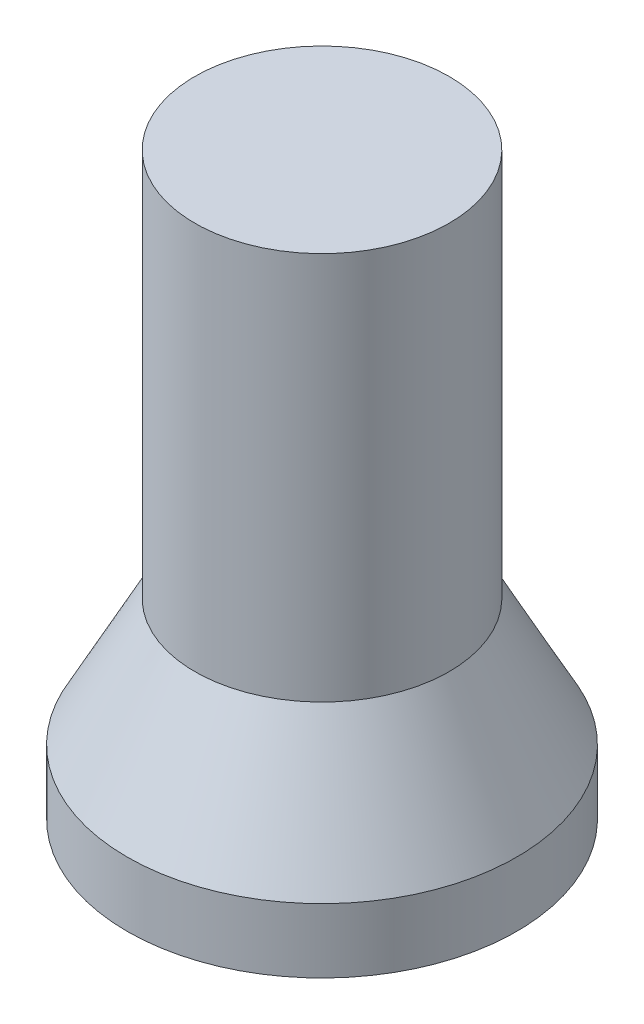
ISO-10303-21;
HEADER;
FILE_DESCRIPTION(('STEP AP214'),'2;1');
FILE_NAME('part.step','',(''),(''),'','','');
FILE_SCHEMA(('AUTOMOTIVE_DESIGN { 1 0 10303 214 1 1 1 1 }'));
ENDSEC;
DATA;
#1=APPLICATION_CONTEXT('core data for automotive mechanical design processes');
#2=APPLICATION_PROTOCOL_DEFINITION('international standard','automotive_design',2000,#1);
#3=PRODUCT_CONTEXT('',#1,'mechanical');
#4=PRODUCT('Part','Part','',(#3));
#5=PRODUCT_RELATED_PRODUCT_CATEGORY('part','',(#4));
#6=PRODUCT_DEFINITION_FORMATION('','',#4);
#7=PRODUCT_DEFINITION_CONTEXT('part definition',#1,'design');
#8=PRODUCT_DEFINITION('design','',#6,#7);
#9=PRODUCT_DEFINITION_SHAPE('','',#8);
#10=(LENGTH_UNIT() NAMED_UNIT(*) SI_UNIT(.MILLI.,.METRE.));
#11=(NAMED_UNIT(*) PLANE_ANGLE_UNIT() SI_UNIT($,.RADIAN.));
#12=(NAMED_UNIT(*) SI_UNIT($,.STERADIAN.) SOLID_ANGLE_UNIT());
#13=UNCERTAINTY_MEASURE_WITH_UNIT(LENGTH_MEASURE(1.E-05),#10,'distance_accuracy_value','');
#14=(GEOMETRIC_REPRESENTATION_CONTEXT(3) GLOBAL_UNCERTAINTY_ASSIGNED_CONTEXT((#13)) GLOBAL_UNIT_ASSIGNED_CONTEXT((#10,
#11,#12)) REPRESENTATION_CONTEXT('',''));
#15=CARTESIAN_POINT('',(0.,0.,0.));
#16=DIRECTION('',(0.,0.,1.));
#17=DIRECTION('',(1.,0.,0.));
#18=AXIS2_PLACEMENT_3D('',#15,#16,#17);
#19=CARTESIAN_POINT('',(0.,3.,-4.51666666666667));
#20=DIRECTION('',(0.,-1.,0.));
#21=DIRECTION('',(0.,0.,-1.));
#22=AXIS2_PLACEMENT_3D('',#19,#20,#21);
#23=PLANE('',#22);
#24=CARTESIAN_POINT('',(0.,3.,0.));
#25=DIRECTION('',(0.,-1.,0.));
#26=DIRECTION('',(0.,0.,-1.));
#27=AXIS2_PLACEMENT_3D('',#24,#25,#26);
#28=CIRCLE('',#27,4.51666666666667);
#29=CARTESIAN_POINT('',(0.,3.,-4.51666666666667));
#30=VERTEX_POINT('',#29);
#31=EDGE_CURVE('E58',#30,#30,#28,.T.);
#32=ORIENTED_EDGE('',*,*,#31,.T.);
#33=EDGE_LOOP('',(#32));
#34=FACE_BOUND('',#33,.T.);
#35=ADVANCED_FACE('F33',(#34),#23,.T.);
#36=CARTESIAN_POINT('',(0.,18.,0.));
#37=DIRECTION('',(0.,1.,0.));
#38=DIRECTION('',(0.,0.,1.));
#39=AXIS2_PLACEMENT_3D('',#36,#37,#38);
#40=PLANE('',#39);
#41=CARTESIAN_POINT('',(0.,18.,0.));
#42=DIRECTION('',(0.,-1.,0.));
#43=DIRECTION('',(0.,0.,-1.));
#44=AXIS2_PLACEMENT_3D('',#41,#42,#43);
#45=CIRCLE('',#44,3.95);
#46=CARTESIAN_POINT('',(0.,18.,-3.95));
#47=VERTEX_POINT('',#46);
#48=EDGE_CURVE('E10',#47,#47,#45,.T.);
#49=ORIENTED_EDGE('',*,*,#48,.F.);
#50=EDGE_LOOP('',(#49));
#51=FACE_BOUND('',#50,.T.);
#52=ADVANCED_FACE('F75',(#51),#40,.T.);
#53=CARTESIAN_POINT('',(0.,-43.5149122258906,0.));
#54=DIRECTION('',(0.,-1.,0.));
#55=DIRECTION('',(0.,0.,-1.));
#56=AXIS2_PLACEMENT_3D('',#53,#54,#55);
#57=CYLINDRICAL_SURFACE('',#56,3.95);
#58=ORIENTED_EDGE('',*,*,#48,.T.);
#59=EDGE_LOOP('',(#58));
#60=FACE_BOUND('',#59,.T.);
#61=CARTESIAN_POINT('',(0.,5.9375,0.));
#62=DIRECTION('',(0.,-1.,0.));
#63=DIRECTION('',(0.,0.,-1.));
#64=AXIS2_PLACEMENT_3D('',#61,#62,#63);
#65=CIRCLE('',#64,3.95);
#66=CARTESIAN_POINT('',(0.,5.9375,-3.95));
#67=VERTEX_POINT('',#66);
#68=EDGE_CURVE('E39',#67,#67,#65,.T.);
#69=ORIENTED_EDGE('',*,*,#68,.F.);
#70=EDGE_LOOP('',(#69));
#71=FACE_BOUND('',#70,.T.);
#72=ADVANCED_FACE('F79',(#60,#71),#57,.T.);
#73=CARTESIAN_POINT('',(0.,2.,0.));
#74=DIRECTION('',(0.,-1.,0.));
#75=DIRECTION('',(0.,0.,-1.));
#76=AXIS2_PLACEMENT_3D('',#73,#74,#75);
#77=CONICAL_SURFACE('',#76,6.05,0.489957326253728);
#78=ORIENTED_EDGE('',*,*,#68,.T.);
#79=EDGE_LOOP('',(#78));
#80=FACE_BOUND('',#79,.T.);
#81=CARTESIAN_POINT('',(0.,2.,0.));
#82=DIRECTION('',(0.,-1.,0.));
#83=DIRECTION('',(0.,0.,-1.));
#84=AXIS2_PLACEMENT_3D('',#81,#82,#83);
#85=CIRCLE('',#84,6.05);
#86=CARTESIAN_POINT('',(0.,2.,-6.05));
#87=VERTEX_POINT('',#86);
#88=EDGE_CURVE('E43',#87,#87,#85,.T.);
#89=ORIENTED_EDGE('',*,*,#88,.F.);
#90=EDGE_LOOP('',(#89));
#91=FACE_BOUND('',#90,.T.);
#92=ADVANCED_FACE('F84',(#80,#91),#77,.T.);
#93=CARTESIAN_POINT('',(0.,-43.5149122258906,0.));
#94=DIRECTION('',(0.,-1.,0.));
#95=DIRECTION('',(0.,0.,-1.));
#96=AXIS2_PLACEMENT_3D('',#93,#94,#95);
#97=CYLINDRICAL_SURFACE('',#96,6.05);
#98=ORIENTED_EDGE('',*,*,#88,.T.);
#99=EDGE_LOOP('',(#98));
#100=FACE_BOUND('',#99,.T.);
#101=CARTESIAN_POINT('',(0.,0.,0.));
#102=DIRECTION('',(0.,-1.,0.));
#103=DIRECTION('',(0.,0.,-1.));
#104=AXIS2_PLACEMENT_3D('',#101,#102,#103);
#105=CIRCLE('',#104,6.05);
#106=CARTESIAN_POINT('',(0.,0.,-6.05));
#107=VERTEX_POINT('',#106);
#108=EDGE_CURVE('E47',#107,#107,#105,.T.);
#109=ORIENTED_EDGE('',*,*,#108,.F.);
#110=EDGE_LOOP('',(#109));
#111=FACE_BOUND('',#110,.T.);
#112=ADVANCED_FACE('F89',(#100,#111),#97,.T.);
#113=CARTESIAN_POINT('',(0.,0.,-5.05));
#114=DIRECTION('',(0.,-1.,0.));
#115=DIRECTION('',(0.,0.,-1.));
#116=AXIS2_PLACEMENT_3D('',#113,#114,#115);
#117=PLANE('',#116);
#118=ORIENTED_EDGE('',*,*,#108,.T.);
#119=EDGE_LOOP('',(#118));
#120=FACE_BOUND('',#119,.T.);
#121=CARTESIAN_POINT('',(0.,0.,0.));
#122=DIRECTION('',(0.,-1.,0.));
#123=DIRECTION('',(0.,0.,-1.));
#124=AXIS2_PLACEMENT_3D('',#121,#122,#123);
#125=CIRCLE('',#124,5.05);
#126=CARTESIAN_POINT('',(0.,0.,-5.05));
#127=VERTEX_POINT('',#126);
#128=EDGE_CURVE('E52',#127,#127,#125,.T.);
#129=ORIENTED_EDGE('',*,*,#128,.F.);
#130=EDGE_LOOP('',(#129));
#131=FACE_BOUND('',#130,.T.);
#132=ADVANCED_FACE('F71',(#120,#131),#117,.T.);
#133=CARTESIAN_POINT('',(0.,-43.5149122258906,0.));
#134=DIRECTION('',(0.,-1.,0.));
#135=DIRECTION('',(0.,0.,-1.));
#136=AXIS2_PLACEMENT_3D('',#133,#134,#135);
#137=CYLINDRICAL_SURFACE('',#136,5.05);
#138=ORIENTED_EDGE('',*,*,#128,.T.);
#139=EDGE_LOOP('',(#138));
#140=FACE_BOUND('',#139,.T.);
#141=CARTESIAN_POINT('',(0.,2.,0.));
#142=DIRECTION('',(0.,-1.,0.));
#143=DIRECTION('',(0.,0.,-1.));
#144=AXIS2_PLACEMENT_3D('',#141,#142,#143);
#145=CIRCLE('',#144,5.05);
#146=CARTESIAN_POINT('',(0.,2.,-5.05));
#147=VERTEX_POINT('',#146);
#148=EDGE_CURVE('E55',#147,#147,#145,.T.);
#149=ORIENTED_EDGE('',*,*,#148,.F.);
#150=EDGE_LOOP('',(#149));
#151=FACE_BOUND('',#150,.T.);
#152=ADVANCED_FACE('F65',(#140,#151),#137,.F.);
#153=CARTESIAN_POINT('',(0.,3.,0.));
#154=DIRECTION('',(0.,-1.,0.));
#155=DIRECTION('',(0.,0.,-1.));
#156=AXIS2_PLACEMENT_3D('',#153,#154,#155);
#157=CONICAL_SURFACE('',#156,4.51666666666667,0.489957326253728);
#158=ORIENTED_EDGE('',*,*,#148,.T.);
#159=EDGE_LOOP('',(#158));
#160=FACE_BOUND('',#159,.T.);
#161=ORIENTED_EDGE('',*,*,#31,.F.);
#162=EDGE_LOOP('',(#161));
#163=FACE_BOUND('',#162,.T.);
#164=ADVANCED_FACE('F63',(#160,#163),#157,.F.);
#165=CLOSED_SHELL('',(#35,#52,#72,#92,#112,#132,#152,#164));
#166=MANIFOLD_SOLID_BREP('B2',#165);
#167=ADVANCED_BREP_SHAPE_REPRESENTATION('',(#18,#166),#14);
#168=SHAPE_DEFINITION_REPRESENTATION(#9,#167);
ENDSEC;
END-ISO-10303-21;
